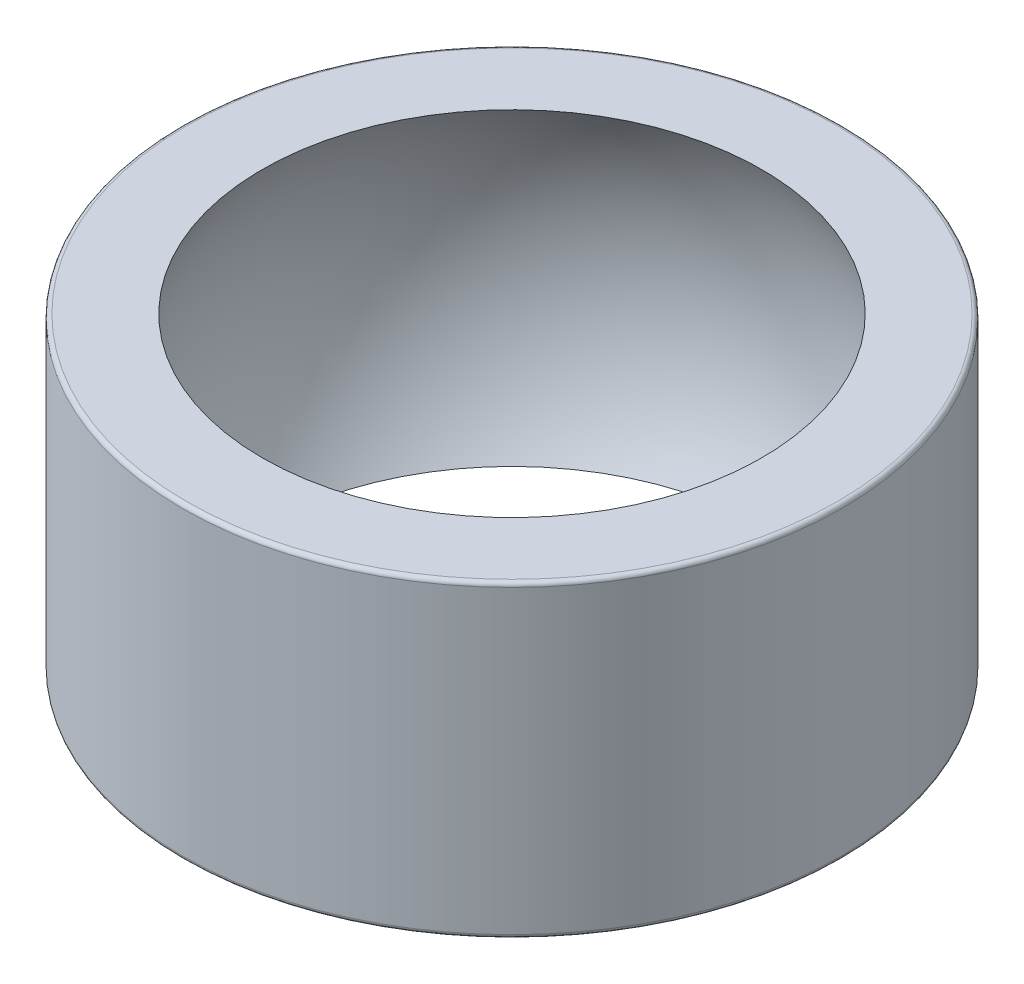
ISO-10303-21;
HEADER;
FILE_DESCRIPTION(('STEP AP214'),'2;1');
FILE_NAME('part.step','',(''),(''),'','','');
FILE_SCHEMA(('AUTOMOTIVE_DESIGN { 1 0 10303 214 1 1 1 1 }'));
ENDSEC;
DATA;
#1=APPLICATION_CONTEXT('core data for automotive mechanical design processes');
#2=APPLICATION_PROTOCOL_DEFINITION('international standard','automotive_design',2000,#1);
#3=PRODUCT_CONTEXT('',#1,'mechanical');
#4=PRODUCT('Part','Part','',(#3));
#5=PRODUCT_RELATED_PRODUCT_CATEGORY('part','',(#4));
#6=PRODUCT_DEFINITION_FORMATION('','',#4);
#7=PRODUCT_DEFINITION_CONTEXT('part definition',#1,'design');
#8=PRODUCT_DEFINITION('design','',#6,#7);
#9=PRODUCT_DEFINITION_SHAPE('','',#8);
#10=(LENGTH_UNIT() NAMED_UNIT(*) SI_UNIT(.MILLI.,.METRE.));
#11=(NAMED_UNIT(*) PLANE_ANGLE_UNIT() SI_UNIT($,.RADIAN.));
#12=(NAMED_UNIT(*) SI_UNIT($,.STERADIAN.) SOLID_ANGLE_UNIT());
#13=UNCERTAINTY_MEASURE_WITH_UNIT(LENGTH_MEASURE(1.E-05),#10,'distance_accuracy_value','');
#14=(GEOMETRIC_REPRESENTATION_CONTEXT(3) GLOBAL_UNCERTAINTY_ASSIGNED_CONTEXT((#13)) GLOBAL_UNIT_ASSIGNED_CONTEXT((#10,
#11,#12)) REPRESENTATION_CONTEXT('',''));
#15=CARTESIAN_POINT('',(0.,0.,0.));
#16=DIRECTION('',(0.,0.,1.));
#17=DIRECTION('',(1.,0.,0.));
#18=AXIS2_PLACEMENT_3D('',#15,#16,#17);
#19=CARTESIAN_POINT('',(0.,7.5,0.));
#20=DIRECTION('',(0.,-1.,0.));
#21=DIRECTION('',(0.,0.,-1.));
#22=AXIS2_PLACEMENT_3D('',#19,#20,#21);
#23=CYLINDRICAL_SURFACE('',#22,16.);
#24=CARTESIAN_POINT('',(0.,-7.3,0.));
#25=DIRECTION('',(0.,1.,0.));
#26=DIRECTION('',(0.,0.,1.));
#27=AXIS2_PLACEMENT_3D('',#24,#25,#26);
#28=CIRCLE('',#27,16.);
#29=CARTESIAN_POINT('',(0.,-7.3,16.));
#30=VERTEX_POINT('',#29);
#31=EDGE_CURVE('E41',#30,#30,#28,.T.);
#32=ORIENTED_EDGE('',*,*,#31,.T.);
#33=EDGE_LOOP('',(#32));
#34=FACE_BOUND('',#33,.T.);
#35=CARTESIAN_POINT('',(0.,7.3,0.));
#36=DIRECTION('',(0.,1.,0.));
#37=DIRECTION('',(0.,0.,1.));
#38=AXIS2_PLACEMENT_3D('',#35,#36,#37);
#39=CIRCLE('',#38,16.);
#40=CARTESIAN_POINT('',(0.,7.3,16.));
#41=VERTEX_POINT('',#40);
#42=EDGE_CURVE('E45',#41,#41,#39,.F.);
#43=ORIENTED_EDGE('',*,*,#42,.T.);
#44=EDGE_LOOP('',(#43));
#45=FACE_BOUND('',#44,.T.);
#46=ADVANCED_FACE('F30',(#34,#45),#23,.T.);
#47=CARTESIAN_POINT('',(0.,7.5,0.));
#48=DIRECTION('',(0.,1.,0.));
#49=DIRECTION('',(0.,0.,1.));
#50=AXIS2_PLACEMENT_3D('',#47,#48,#49);
#51=PLANE('',#50);
#52=CARTESIAN_POINT('',(0.,7.5,0.));
#53=DIRECTION('',(0.,1.,0.));
#54=DIRECTION('',(0.,0.,1.));
#55=AXIS2_PLACEMENT_3D('',#52,#53,#54);
#56=CIRCLE('',#55,15.8);
#57=CARTESIAN_POINT('',(0.,7.5,15.8));
#58=VERTEX_POINT('',#57);
#59=EDGE_CURVE('E10',#58,#58,#56,.T.);
#60=ORIENTED_EDGE('',*,*,#59,.T.);
#61=EDGE_LOOP('',(#60));
#62=FACE_BOUND('',#61,.T.);
#63=CARTESIAN_POINT('',(0.,7.5,0.));
#64=DIRECTION('',(0.,1.,0.));
#65=DIRECTION('',(0.,0.,1.));
#66=AXIS2_PLACEMENT_3D('',#63,#64,#65);
#67=CIRCLE('',#66,12.1283799412782);
#68=CARTESIAN_POINT('',(0.,7.5,12.1283799412782));
#69=VERTEX_POINT('',#68);
#70=EDGE_CURVE('E50',#69,#69,#67,.T.);
#71=ORIENTED_EDGE('',*,*,#70,.F.);
#72=EDGE_LOOP('',(#71));
#73=FACE_BOUND('',#72,.T.);
#74=ADVANCED_FACE('F60',(#62,#73),#51,.T.);
#75=CARTESIAN_POINT('',(0.,-7.5,0.));
#76=DIRECTION('',(0.,1.,0.));
#77=DIRECTION('',(0.,0.,1.));
#78=AXIS2_PLACEMENT_3D('',#75,#76,#77);
#79=PLANE('',#78);
#80=CARTESIAN_POINT('',(0.,-7.5,0.));
#81=DIRECTION('',(0.,1.,0.));
#82=DIRECTION('',(0.,0.,1.));
#83=AXIS2_PLACEMENT_3D('',#80,#81,#82);
#84=CIRCLE('',#83,15.8);
#85=CARTESIAN_POINT('',(0.,-7.5,15.8));
#86=VERTEX_POINT('',#85);
#87=EDGE_CURVE('E37',#86,#86,#84,.F.);
#88=ORIENTED_EDGE('',*,*,#87,.T.);
#89=EDGE_LOOP('',(#88));
#90=FACE_BOUND('',#89,.T.);
#91=CARTESIAN_POINT('',(0.,-7.5,0.));
#92=DIRECTION('',(0.,1.,0.));
#93=DIRECTION('',(0.,0.,1.));
#94=AXIS2_PLACEMENT_3D('',#91,#92,#93);
#95=CIRCLE('',#94,12.1283799412782);
#96=CARTESIAN_POINT('',(0.,-7.5,12.1283799412782));
#97=VERTEX_POINT('',#96);
#98=EDGE_CURVE('E51',#97,#97,#95,.T.);
#99=ORIENTED_EDGE('',*,*,#98,.T.);
#100=EDGE_LOOP('',(#99));
#101=FACE_BOUND('',#100,.T.);
#102=ADVANCED_FACE('F62',(#90,#101),#79,.F.);
#103=CARTESIAN_POINT('',(0.,0.,0.));
#104=DIRECTION('',(0.,-1.,0.));
#105=DIRECTION('',(-1.,0.,0.));
#106=AXIS2_PLACEMENT_3D('',#103,#104,#105);
#107=SPHERICAL_SURFACE('',#106,14.26);
#108=ORIENTED_EDGE('',*,*,#70,.T.);
#109=EDGE_LOOP('',(#108));
#110=FACE_BOUND('',#109,.T.);
#111=ORIENTED_EDGE('',*,*,#98,.F.);
#112=EDGE_LOOP('',(#111));
#113=FACE_BOUND('',#112,.T.);
#114=ADVANCED_FACE('F57',(#110,#113),#107,.F.);
#115=CARTESIAN_POINT('',(0.,-7.3,0.));
#116=DIRECTION('',(0.,1.,0.));
#117=DIRECTION('',(0.,0.,1.));
#118=AXIS2_PLACEMENT_3D('',#115,#116,#117);
#119=TOROIDAL_SURFACE('',#118,15.8,0.2);
#120=ORIENTED_EDGE('',*,*,#87,.F.);
#121=EDGE_LOOP('',(#120));
#122=FACE_BOUND('',#121,.T.);
#123=ORIENTED_EDGE('',*,*,#31,.F.);
#124=EDGE_LOOP('',(#123));
#125=FACE_BOUND('',#124,.T.);
#126=ADVANCED_FACE('F72',(#122,#125),#119,.T.);
#127=CARTESIAN_POINT('',(0.,7.3,0.));
#128=DIRECTION('',(0.,1.,0.));
#129=DIRECTION('',(0.,0.,1.));
#130=AXIS2_PLACEMENT_3D('',#127,#128,#129);
#131=TOROIDAL_SURFACE('',#130,15.8,0.2);
#132=ORIENTED_EDGE('',*,*,#42,.F.);
#133=EDGE_LOOP('',(#132));
#134=FACE_BOUND('',#133,.T.);
#135=ORIENTED_EDGE('',*,*,#59,.F.);
#136=EDGE_LOOP('',(#135));
#137=FACE_BOUND('',#136,.T.);
#138=ADVANCED_FACE('F32',(#134,#137),#131,.T.);
#139=CLOSED_SHELL('',(#46,#74,#102,#114,#126,#138));
#140=MANIFOLD_SOLID_BREP('B2',#139);
#141=ADVANCED_BREP_SHAPE_REPRESENTATION('',(#18,#140),#14);
#142=SHAPE_DEFINITION_REPRESENTATION(#9,#141);
ENDSEC;
END-ISO-10303-21;
